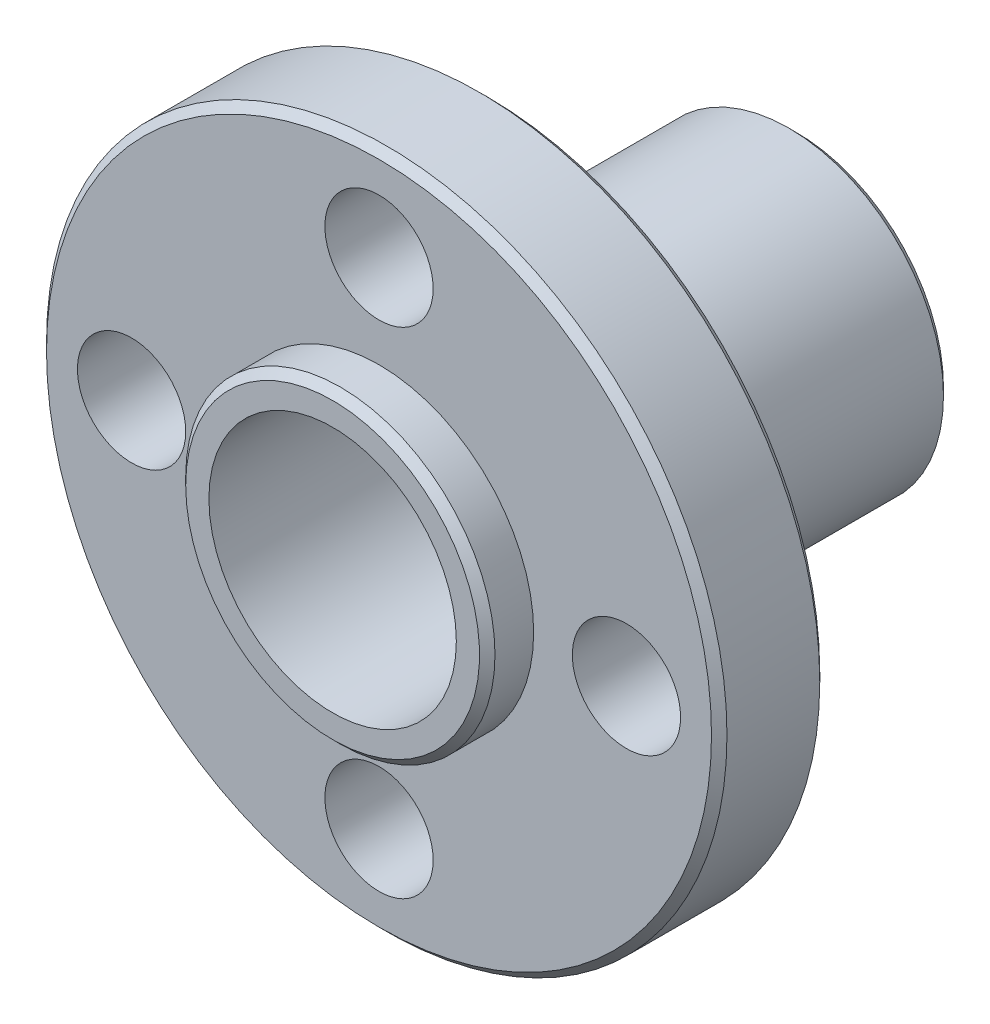
ISO-10303-21;
HEADER;
FILE_DESCRIPTION(('STEP AP214'),'2;1');
FILE_NAME('part.step','',(''),(''),'','','');
FILE_SCHEMA(('AUTOMOTIVE_DESIGN { 1 0 10303 214 1 1 1 1 }'));
ENDSEC;
DATA;
#1=APPLICATION_CONTEXT('core data for automotive mechanical design processes');
#2=APPLICATION_PROTOCOL_DEFINITION('international standard','automotive_design',2000,#1);
#3=PRODUCT_CONTEXT('',#1,'mechanical');
#4=PRODUCT('Part','Part','',(#3));
#5=PRODUCT_RELATED_PRODUCT_CATEGORY('part','',(#4));
#6=PRODUCT_DEFINITION_FORMATION('','',#4);
#7=PRODUCT_DEFINITION_CONTEXT('part definition',#1,'design');
#8=PRODUCT_DEFINITION('design','',#6,#7);
#9=PRODUCT_DEFINITION_SHAPE('','',#8);
#10=(LENGTH_UNIT() NAMED_UNIT(*) SI_UNIT(.MILLI.,.METRE.));
#11=(NAMED_UNIT(*) PLANE_ANGLE_UNIT() SI_UNIT($,.RADIAN.));
#12=(NAMED_UNIT(*) SI_UNIT($,.STERADIAN.) SOLID_ANGLE_UNIT());
#13=UNCERTAINTY_MEASURE_WITH_UNIT(LENGTH_MEASURE(1.E-05),#10,'distance_accuracy_value','');
#14=(GEOMETRIC_REPRESENTATION_CONTEXT(3) GLOBAL_UNCERTAINTY_ASSIGNED_CONTEXT((#13)) GLOBAL_UNIT_ASSIGNED_CONTEXT((#10,
#11,#12)) REPRESENTATION_CONTEXT('',''));
#15=CARTESIAN_POINT('',(0.,0.,0.));
#16=DIRECTION('',(0.,0.,1.));
#17=DIRECTION('',(1.,0.,0.));
#18=AXIS2_PLACEMENT_3D('',#15,#16,#17);
#19=CARTESIAN_POINT('',(0.,5.,0.));
#20=DIRECTION('',(0.,0.,-1.));
#21=DIRECTION('',(-1.,0.,0.));
#22=AXIS2_PLACEMENT_3D('',#19,#20,#21);
#23=PLANE('',#22);
#24=CARTESIAN_POINT('',(0.,0.,0.));
#25=DIRECTION('',(0.,0.,-1.));
#26=DIRECTION('',(-1.,0.,0.));
#27=AXIS2_PLACEMENT_3D('',#24,#25,#26);
#28=CIRCLE('',#27,4.75000000000004);
#29=CARTESIAN_POINT('',(-4.75000000000004,0.,0.));
#30=VERTEX_POINT('',#29);
#31=EDGE_CURVE('E75',#30,#30,#28,.F.);
#32=ORIENTED_EDGE('',*,*,#31,.T.);
#33=EDGE_LOOP('',(#32));
#34=FACE_BOUND('',#33,.T.);
#35=CARTESIAN_POINT('',(0.,0.,0.));
#36=DIRECTION('',(0.,0.,1.));
#37=DIRECTION('',(1.,0.,0.));
#38=AXIS2_PLACEMENT_3D('',#35,#36,#37);
#39=CIRCLE('',#38,4.00000000000002);
#40=CARTESIAN_POINT('',(4.00000000000002,0.,0.));
#41=VERTEX_POINT('',#40);
#42=EDGE_CURVE('E79',#41,#41,#39,.T.);
#43=ORIENTED_EDGE('',*,*,#42,.F.);
#44=EDGE_LOOP('',(#43));
#45=FACE_BOUND('',#44,.T.);
#46=ADVANCED_FACE('F38',(#34,#45),#23,.F.);
#47=CARTESIAN_POINT('',(0.,0.,903.973270395925));
#48=DIRECTION('',(0.,0.,1.));
#49=DIRECTION('',(1.,0.,0.));
#50=AXIS2_PLACEMENT_3D('',#47,#48,#49);
#51=CYLINDRICAL_SURFACE('',#50,4.00000000000002);
#52=CARTESIAN_POINT('',(0.,0.,-15.));
#53=DIRECTION('',(0.,0.,1.));
#54=DIRECTION('',(1.,0.,0.));
#55=AXIS2_PLACEMENT_3D('',#52,#53,#54);
#56=CIRCLE('',#55,4.00000000000002);
#57=CARTESIAN_POINT('',(4.00000000000002,0.,-15.));
#58=VERTEX_POINT('',#57);
#59=EDGE_CURVE('E83',#58,#58,#56,.T.);
#60=ORIENTED_EDGE('',*,*,#59,.F.);
#61=EDGE_LOOP('',(#60));
#62=FACE_BOUND('',#61,.T.);
#63=ORIENTED_EDGE('',*,*,#42,.T.);
#64=EDGE_LOOP('',(#63));
#65=FACE_BOUND('',#64,.T.);
#66=ADVANCED_FACE('F160',(#62,#65),#51,.F.);
#67=CARTESIAN_POINT('',(0.,4.00000000000002,-15.));
#68=DIRECTION('',(0.,0.,1.));
#69=DIRECTION('',(1.,0.,0.));
#70=AXIS2_PLACEMENT_3D('',#67,#68,#69);
#71=PLANE('',#70);
#72=CARTESIAN_POINT('',(0.,0.,-15.));
#73=DIRECTION('',(0.,0.,1.));
#74=DIRECTION('',(1.,0.,0.));
#75=AXIS2_PLACEMENT_3D('',#72,#73,#74);
#76=CIRCLE('',#75,4.7500000000001);
#77=CARTESIAN_POINT('',(4.7500000000001,0.,-15.));
#78=VERTEX_POINT('',#77);
#79=EDGE_CURVE('E10',#78,#78,#76,.F.);
#80=ORIENTED_EDGE('',*,*,#79,.T.);
#81=EDGE_LOOP('',(#80));
#82=FACE_BOUND('',#81,.T.);
#83=ORIENTED_EDGE('',*,*,#59,.T.);
#84=EDGE_LOOP('',(#83));
#85=FACE_BOUND('',#84,.T.);
#86=ADVANCED_FACE('F166',(#82,#85),#71,.F.);
#87=CARTESIAN_POINT('',(0.,0.,903.973270395925));
#88=DIRECTION('',(0.,0.,1.));
#89=DIRECTION('',(1.,0.,0.));
#90=AXIS2_PLACEMENT_3D('',#87,#88,#89);
#91=CYLINDRICAL_SURFACE('',#90,5.);
#92=CARTESIAN_POINT('',(0.,0.,-14.75));
#93=DIRECTION('',(0.,0.,1.));
#94=DIRECTION('',(1.,0.,0.));
#95=AXIS2_PLACEMENT_3D('',#92,#93,#94);
#96=CIRCLE('',#95,5.);
#97=CARTESIAN_POINT('',(5.,0.,-14.75));
#98=VERTEX_POINT('',#97);
#99=EDGE_CURVE('E47',#98,#98,#96,.T.);
#100=ORIENTED_EDGE('',*,*,#99,.T.);
#101=EDGE_LOOP('',(#100));
#102=FACE_BOUND('',#101,.T.);
#103=CARTESIAN_POINT('',(0.,0.,-5.));
#104=DIRECTION('',(0.,0.,1.));
#105=DIRECTION('',(1.,0.,0.));
#106=AXIS2_PLACEMENT_3D('',#103,#104,#105);
#107=CIRCLE('',#106,5.);
#108=CARTESIAN_POINT('',(5.,0.,-5.));
#109=VERTEX_POINT('',#108);
#110=EDGE_CURVE('E87',#109,#109,#107,.T.);
#111=ORIENTED_EDGE('',*,*,#110,.F.);
#112=EDGE_LOOP('',(#111));
#113=FACE_BOUND('',#112,.T.);
#114=ADVANCED_FACE('F203',(#102,#113),#91,.T.);
#115=CARTESIAN_POINT('',(0.,5.,-5.));
#116=DIRECTION('',(0.,0.,1.));
#117=DIRECTION('',(1.,0.,0.));
#118=AXIS2_PLACEMENT_3D('',#115,#116,#117);
#119=PLANE('',#118);
#120=CARTESIAN_POINT('',(0.,8.,-5.));
#121=DIRECTION('',(0.,0.,1.));
#122=DIRECTION('',(1.,0.,0.));
#123=AXIS2_PLACEMENT_3D('',#120,#121,#122);
#124=CIRCLE('',#123,1.75);
#125=CARTESIAN_POINT('',(1.75,8.,-5.));
#126=VERTEX_POINT('',#125);
#127=EDGE_CURVE('E95',#126,#126,#124,.F.);
#128=ORIENTED_EDGE('',*,*,#127,.F.);
#129=EDGE_LOOP('',(#128));
#130=FACE_BOUND('',#129,.T.);
#131=CARTESIAN_POINT('',(8.,0.,-5.));
#132=DIRECTION('',(0.,0.,1.));
#133=DIRECTION('',(1.,0.,0.));
#134=AXIS2_PLACEMENT_3D('',#131,#132,#133);
#135=CIRCLE('',#134,1.75);
#136=CARTESIAN_POINT('',(9.75,0.,-5.));
#137=VERTEX_POINT('',#136);
#138=EDGE_CURVE('E113',#137,#137,#135,.F.);
#139=ORIENTED_EDGE('',*,*,#138,.F.);
#140=EDGE_LOOP('',(#139));
#141=FACE_BOUND('',#140,.T.);
#142=CARTESIAN_POINT('',(0.,-8.,-5.));
#143=DIRECTION('',(0.,0.,1.));
#144=DIRECTION('',(1.,0.,0.));
#145=AXIS2_PLACEMENT_3D('',#142,#143,#144);
#146=CIRCLE('',#145,1.75);
#147=CARTESIAN_POINT('',(1.75,-8.,-5.));
#148=VERTEX_POINT('',#147);
#149=EDGE_CURVE('E105',#148,#148,#146,.F.);
#150=ORIENTED_EDGE('',*,*,#149,.F.);
#151=EDGE_LOOP('',(#150));
#152=FACE_BOUND('',#151,.T.);
#153=CARTESIAN_POINT('',(-8.,0.,-5.));
#154=DIRECTION('',(0.,0.,1.));
#155=DIRECTION('',(1.,0.,0.));
#156=AXIS2_PLACEMENT_3D('',#153,#154,#155);
#157=CIRCLE('',#156,1.75);
#158=CARTESIAN_POINT('',(-6.25,0.,-5.));
#159=VERTEX_POINT('',#158);
#160=EDGE_CURVE('E96',#159,#159,#157,.F.);
#161=ORIENTED_EDGE('',*,*,#160,.F.);
#162=EDGE_LOOP('',(#161));
#163=FACE_BOUND('',#162,.T.);
#164=CARTESIAN_POINT('',(0.,0.,-5.));
#165=DIRECTION('',(0.,0.,1.));
#166=DIRECTION('',(1.,0.,0.));
#167=AXIS2_PLACEMENT_3D('',#164,#165,#166);
#168=CIRCLE('',#167,10.75);
#169=CARTESIAN_POINT('',(10.75,0.,-5.));
#170=VERTEX_POINT('',#169);
#171=EDGE_CURVE('E52',#170,#170,#168,.F.);
#172=ORIENTED_EDGE('',*,*,#171,.T.);
#173=EDGE_LOOP('',(#172));
#174=FACE_BOUND('',#173,.T.);
#175=ORIENTED_EDGE('',*,*,#110,.T.);
#176=EDGE_LOOP('',(#175));
#177=FACE_BOUND('',#176,.T.);
#178=ADVANCED_FACE('F196',(#130,#141,#152,#163,#174,#177),#119,.F.);
#179=CARTESIAN_POINT('',(0.,0.,903.973270395925));
#180=DIRECTION('',(0.,0.,1.));
#181=DIRECTION('',(1.,0.,0.));
#182=AXIS2_PLACEMENT_3D('',#179,#180,#181);
#183=CYLINDRICAL_SURFACE('',#182,11.);
#184=CARTESIAN_POINT('',(0.,0.,-1.74999999999992));
#185=DIRECTION('',(0.,0.,-1.));
#186=DIRECTION('',(-1.,0.,0.));
#187=AXIS2_PLACEMENT_3D('',#184,#185,#186);
#188=CIRCLE('',#187,11.);
#189=CARTESIAN_POINT('',(-11.,0.,-1.74999999999992));
#190=VERTEX_POINT('',#189);
#191=EDGE_CURVE('E57',#190,#190,#188,.T.);
#192=ORIENTED_EDGE('',*,*,#191,.T.);
#193=EDGE_LOOP('',(#192));
#194=FACE_BOUND('',#193,.T.);
#195=CARTESIAN_POINT('',(0.,0.,-4.75000000000003));
#196=DIRECTION('',(0.,0.,1.));
#197=DIRECTION('',(1.,0.,0.));
#198=AXIS2_PLACEMENT_3D('',#195,#196,#197);
#199=CIRCLE('',#198,11.);
#200=CARTESIAN_POINT('',(11.,0.,-4.75000000000003));
#201=VERTEX_POINT('',#200);
#202=EDGE_CURVE('E63',#201,#201,#199,.T.);
#203=ORIENTED_EDGE('',*,*,#202,.T.);
#204=EDGE_LOOP('',(#203));
#205=FACE_BOUND('',#204,.T.);
#206=ADVANCED_FACE('F135',(#194,#205),#183,.T.);
#207=CARTESIAN_POINT('',(0.,11.,-1.5));
#208=DIRECTION('',(0.,0.,-1.));
#209=DIRECTION('',(-1.,0.,0.));
#210=AXIS2_PLACEMENT_3D('',#207,#208,#209);
#211=PLANE('',#210);
#212=CARTESIAN_POINT('',(0.,8.,-1.5));
#213=DIRECTION('',(0.,0.,1.));
#214=DIRECTION('',(1.,0.,0.));
#215=AXIS2_PLACEMENT_3D('',#212,#213,#214);
#216=CIRCLE('',#215,1.75);
#217=CARTESIAN_POINT('',(1.75,8.,-1.5));
#218=VERTEX_POINT('',#217);
#219=EDGE_CURVE('E117',#218,#218,#216,.T.);
#220=ORIENTED_EDGE('',*,*,#219,.F.);
#221=EDGE_LOOP('',(#220));
#222=FACE_BOUND('',#221,.T.);
#223=CARTESIAN_POINT('',(8.,0.,-1.5));
#224=DIRECTION('',(0.,0.,1.));
#225=DIRECTION('',(1.,0.,0.));
#226=AXIS2_PLACEMENT_3D('',#223,#224,#225);
#227=CIRCLE('',#226,1.75);
#228=CARTESIAN_POINT('',(9.75,0.,-1.5));
#229=VERTEX_POINT('',#228);
#230=EDGE_CURVE('E109',#229,#229,#227,.T.);
#231=ORIENTED_EDGE('',*,*,#230,.F.);
#232=EDGE_LOOP('',(#231));
#233=FACE_BOUND('',#232,.T.);
#234=CARTESIAN_POINT('',(0.,-8.,-1.5));
#235=DIRECTION('',(0.,0.,1.));
#236=DIRECTION('',(1.,0.,0.));
#237=AXIS2_PLACEMENT_3D('',#234,#235,#236);
#238=CIRCLE('',#237,1.75);
#239=CARTESIAN_POINT('',(1.75,-8.,-1.5));
#240=VERTEX_POINT('',#239);
#241=EDGE_CURVE('E100',#240,#240,#238,.T.);
#242=ORIENTED_EDGE('',*,*,#241,.F.);
#243=EDGE_LOOP('',(#242));
#244=FACE_BOUND('',#243,.T.);
#245=CARTESIAN_POINT('',(-8.,0.,-1.5));
#246=DIRECTION('',(0.,0.,1.));
#247=DIRECTION('',(1.,0.,0.));
#248=AXIS2_PLACEMENT_3D('',#245,#246,#247);
#249=CIRCLE('',#248,1.75);
#250=CARTESIAN_POINT('',(-6.25,0.,-1.5));
#251=VERTEX_POINT('',#250);
#252=EDGE_CURVE('E101',#251,#251,#249,.T.);
#253=ORIENTED_EDGE('',*,*,#252,.F.);
#254=EDGE_LOOP('',(#253));
#255=FACE_BOUND('',#254,.T.);
#256=CARTESIAN_POINT('',(0.,0.,-1.5));
#257=DIRECTION('',(0.,0.,-1.));
#258=DIRECTION('',(-1.,0.,0.));
#259=AXIS2_PLACEMENT_3D('',#256,#257,#258);
#260=CIRCLE('',#259,10.7500000000001);
#261=CARTESIAN_POINT('',(-10.7500000000001,0.,-1.5));
#262=VERTEX_POINT('',#261);
#263=EDGE_CURVE('E67',#262,#262,#260,.F.);
#264=ORIENTED_EDGE('',*,*,#263,.T.);
#265=EDGE_LOOP('',(#264));
#266=FACE_BOUND('',#265,.T.);
#267=CARTESIAN_POINT('',(0.,0.,-1.49999999999995));
#268=DIRECTION('',(0.,0.,1.));
#269=DIRECTION('',(1.,0.,0.));
#270=AXIS2_PLACEMENT_3D('',#267,#268,#269);
#271=CIRCLE('',#270,5.);
#272=CARTESIAN_POINT('',(5.,0.,-1.49999999999995));
#273=VERTEX_POINT('',#272);
#274=EDGE_CURVE('E91',#273,#273,#271,.T.);
#275=ORIENTED_EDGE('',*,*,#274,.F.);
#276=EDGE_LOOP('',(#275));
#277=FACE_BOUND('',#276,.T.);
#278=ADVANCED_FACE('F131',(#222,#233,#244,#255,#266,#277),#211,.F.);
#279=CARTESIAN_POINT('',(0.,0.,903.973270395925));
#280=DIRECTION('',(0.,0.,1.));
#281=DIRECTION('',(1.,0.,0.));
#282=AXIS2_PLACEMENT_3D('',#279,#280,#281);
#283=CYLINDRICAL_SURFACE('',#282,5.);
#284=CARTESIAN_POINT('',(0.,0.,-0.249999999999972));
#285=DIRECTION('',(0.,0.,-1.));
#286=DIRECTION('',(-1.,0.,0.));
#287=AXIS2_PLACEMENT_3D('',#284,#285,#286);
#288=CIRCLE('',#287,5.);
#289=CARTESIAN_POINT('',(-5.,0.,-0.249999999999972));
#290=VERTEX_POINT('',#289);
#291=EDGE_CURVE('E71',#290,#290,#288,.T.);
#292=ORIENTED_EDGE('',*,*,#291,.T.);
#293=EDGE_LOOP('',(#292));
#294=FACE_BOUND('',#293,.T.);
#295=ORIENTED_EDGE('',*,*,#274,.T.);
#296=EDGE_LOOP('',(#295));
#297=FACE_BOUND('',#296,.T.);
#298=ADVANCED_FACE('F134',(#294,#297),#283,.T.);
#299=CARTESIAN_POINT('',(0.,0.,0.));
#300=DIRECTION('',(0.,0.,-1.));
#301=DIRECTION('',(-1.,0.,0.));
#302=AXIS2_PLACEMENT_3D('',#299,#300,#301);
#303=CONICAL_SURFACE('',#302,4.75000000000004,0.785398163397419);
#304=ORIENTED_EDGE('',*,*,#291,.F.);
#305=EDGE_LOOP('',(#304));
#306=FACE_BOUND('',#305,.T.);
#307=ORIENTED_EDGE('',*,*,#31,.F.);
#308=EDGE_LOOP('',(#307));
#309=FACE_BOUND('',#308,.T.);
#310=ADVANCED_FACE('F148',(#306,#309),#303,.T.);
#311=CARTESIAN_POINT('',(0.,0.,-1.49999999999995));
#312=DIRECTION('',(0.,0.,-1.));
#313=DIRECTION('',(-1.,0.,0.));
#314=AXIS2_PLACEMENT_3D('',#311,#312,#313);
#315=CONICAL_SURFACE('',#314,10.7500000000001,0.785398163397393);
#316=ORIENTED_EDGE('',*,*,#191,.F.);
#317=EDGE_LOOP('',(#316));
#318=FACE_BOUND('',#317,.T.);
#319=ORIENTED_EDGE('',*,*,#263,.F.);
#320=EDGE_LOOP('',(#319));
#321=FACE_BOUND('',#320,.T.);
#322=ADVANCED_FACE('F155',(#318,#321),#315,.T.);
#323=CARTESIAN_POINT('',(0.,0.,-4.75000000000003));
#324=DIRECTION('',(0.,0.,1.));
#325=DIRECTION('',(1.,0.,0.));
#326=AXIS2_PLACEMENT_3D('',#323,#324,#325);
#327=CONICAL_SURFACE('',#326,11.,0.785398163397549);
#328=ORIENTED_EDGE('',*,*,#171,.F.);
#329=EDGE_LOOP('',(#328));
#330=FACE_BOUND('',#329,.T.);
#331=ORIENTED_EDGE('',*,*,#202,.F.);
#332=EDGE_LOOP('',(#331));
#333=FACE_BOUND('',#332,.T.);
#334=ADVANCED_FACE('F180',(#330,#333),#327,.T.);
#335=CARTESIAN_POINT('',(0.,0.,-14.75));
#336=DIRECTION('',(0.,0.,1.));
#337=DIRECTION('',(1.,0.,0.));
#338=AXIS2_PLACEMENT_3D('',#335,#336,#337);
#339=CONICAL_SURFACE('',#338,5.,0.78539816339733);
#340=ORIENTED_EDGE('',*,*,#79,.F.);
#341=EDGE_LOOP('',(#340));
#342=FACE_BOUND('',#341,.T.);
#343=ORIENTED_EDGE('',*,*,#99,.F.);
#344=EDGE_LOOP('',(#343));
#345=FACE_BOUND('',#344,.T.);
#346=ADVANCED_FACE('F41',(#342,#345),#339,.T.);
#347=CARTESIAN_POINT('',(-8.,0.,-15.001));
#348=DIRECTION('',(0.,0.,1.));
#349=DIRECTION('',(1.,0.,0.));
#350=AXIS2_PLACEMENT_3D('',#347,#348,#349);
#351=CYLINDRICAL_SURFACE('',#350,1.75);
#352=ORIENTED_EDGE('',*,*,#252,.T.);
#353=EDGE_LOOP('',(#352));
#354=FACE_BOUND('',#353,.T.);
#355=ORIENTED_EDGE('',*,*,#160,.T.);
#356=EDGE_LOOP('',(#355));
#357=FACE_BOUND('',#356,.T.);
#358=ADVANCED_FACE('F189',(#354,#357),#351,.F.);
#359=CARTESIAN_POINT('',(0.,-8.,-15.001));
#360=DIRECTION('',(0.,0.,1.));
#361=DIRECTION('',(1.,0.,0.));
#362=AXIS2_PLACEMENT_3D('',#359,#360,#361);
#363=CYLINDRICAL_SURFACE('',#362,1.75);
#364=ORIENTED_EDGE('',*,*,#241,.T.);
#365=EDGE_LOOP('',(#364));
#366=FACE_BOUND('',#365,.T.);
#367=ORIENTED_EDGE('',*,*,#149,.T.);
#368=EDGE_LOOP('',(#367));
#369=FACE_BOUND('',#368,.T.);
#370=ADVANCED_FACE('F240',(#366,#369),#363,.F.);
#371=CARTESIAN_POINT('',(8.,0.,-15.001));
#372=DIRECTION('',(0.,0.,1.));
#373=DIRECTION('',(1.,0.,0.));
#374=AXIS2_PLACEMENT_3D('',#371,#372,#373);
#375=CYLINDRICAL_SURFACE('',#374,1.75);
#376=ORIENTED_EDGE('',*,*,#230,.T.);
#377=EDGE_LOOP('',(#376));
#378=FACE_BOUND('',#377,.T.);
#379=ORIENTED_EDGE('',*,*,#138,.T.);
#380=EDGE_LOOP('',(#379));
#381=FACE_BOUND('',#380,.T.);
#382=ADVANCED_FACE('F249',(#378,#381),#375,.F.);
#383=CARTESIAN_POINT('',(0.,8.,-15.001));
#384=DIRECTION('',(0.,0.,1.));
#385=DIRECTION('',(1.,0.,0.));
#386=AXIS2_PLACEMENT_3D('',#383,#384,#385);
#387=CYLINDRICAL_SURFACE('',#386,1.75);
#388=ORIENTED_EDGE('',*,*,#219,.T.);
#389=EDGE_LOOP('',(#388));
#390=FACE_BOUND('',#389,.T.);
#391=ORIENTED_EDGE('',*,*,#127,.T.);
#392=EDGE_LOOP('',(#391));
#393=FACE_BOUND('',#392,.T.);
#394=ADVANCED_FACE('F128',(#390,#393),#387,.F.);
#395=CLOSED_SHELL('',(#46,#66,#86,#114,#178,#206,#278,#298,#310,#322,#334,#346,#358,#370,#382,#394));
#396=MANIFOLD_SOLID_BREP('B2',#395);
#397=ADVANCED_BREP_SHAPE_REPRESENTATION('',(#18,#396),#14);
#398=SHAPE_DEFINITION_REPRESENTATION(#9,#397);
ENDSEC;
END-ISO-10303-21;
